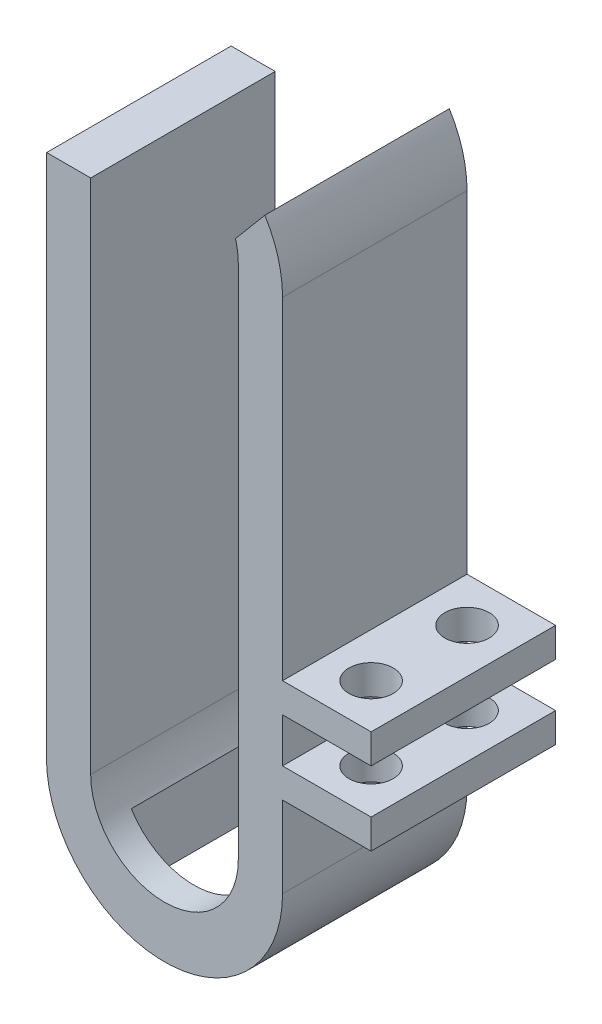
ISO-10303-21;
HEADER;
FILE_DESCRIPTION(('STEP AP214'),'2;1');
FILE_NAME('part.step','',(''),(''),'','','');
FILE_SCHEMA(('AUTOMOTIVE_DESIGN { 1 0 10303 214 1 1 1 1 }'));
ENDSEC;
DATA;
#1=APPLICATION_CONTEXT('core data for automotive mechanical design processes');
#2=APPLICATION_PROTOCOL_DEFINITION('international standard','automotive_design',2000,#1);
#3=PRODUCT_CONTEXT('',#1,'mechanical');
#4=PRODUCT('Part','Part','',(#3));
#5=PRODUCT_RELATED_PRODUCT_CATEGORY('part','',(#4));
#6=PRODUCT_DEFINITION_FORMATION('','',#4);
#7=PRODUCT_DEFINITION_CONTEXT('part definition',#1,'design');
#8=PRODUCT_DEFINITION('design','',#6,#7);
#9=PRODUCT_DEFINITION_SHAPE('','',#8);
#10=(LENGTH_UNIT() NAMED_UNIT(*) SI_UNIT(.MILLI.,.METRE.));
#11=(NAMED_UNIT(*) PLANE_ANGLE_UNIT() SI_UNIT($,.RADIAN.));
#12=(NAMED_UNIT(*) SI_UNIT($,.STERADIAN.) SOLID_ANGLE_UNIT());
#13=UNCERTAINTY_MEASURE_WITH_UNIT(LENGTH_MEASURE(1.E-05),#10,'distance_accuracy_value','');
#14=(GEOMETRIC_REPRESENTATION_CONTEXT(3) GLOBAL_UNCERTAINTY_ASSIGNED_CONTEXT((#13)) GLOBAL_UNIT_ASSIGNED_CONTEXT((#10,
#11,#12)) REPRESENTATION_CONTEXT('',''));
#15=CARTESIAN_POINT('',(0.,0.,0.));
#16=DIRECTION('',(0.,0.,1.));
#17=DIRECTION('',(1.,0.,0.));
#18=AXIS2_PLACEMENT_3D('',#15,#16,#17);
#19=CARTESIAN_POINT('',(7.99999999999995,0.,12.5));
#20=DIRECTION('',(1.,0.,0.));
#21=DIRECTION('',(0.,1.,0.));
#22=AXIS2_PLACEMENT_3D('',#19,#20,#21);
#23=PLANE('',#22);
#24=DIRECTION('',(0.,-1.,0.));
#25=VECTOR('',#24,1.);
#26=CARTESIAN_POINT('',(7.99999999999995,0.,0.));
#27=LINE('',#26,#25);
#28=CARTESIAN_POINT('',(7.99999999999994,-7.5,0.));
#29=VERTEX_POINT('',#28);
#30=CARTESIAN_POINT('',(7.99999999999995,-10.5,0.));
#31=VERTEX_POINT('',#30);
#32=EDGE_CURVE('E278',#29,#31,#27,.T.);
#33=ORIENTED_EDGE('',*,*,#32,.F.);
#34=DIRECTION('',(0.,0.,-1.));
#35=VECTOR('',#34,1.);
#36=CARTESIAN_POINT('',(7.99999999999995,-7.5,12.5));
#37=LINE('',#36,#35);
#38=CARTESIAN_POINT('',(7.99999999999995,-7.5,12.5));
#39=VERTEX_POINT('',#38);
#40=EDGE_CURVE('E347',#39,#29,#37,.T.);
#41=ORIENTED_EDGE('',*,*,#40,.F.);
#42=DIRECTION('',(0.,-1.,0.));
#43=VECTOR('',#42,1.);
#44=CARTESIAN_POINT('',(7.99999999999995,0.,12.5));
#45=LINE('',#44,#43);
#46=CARTESIAN_POINT('',(7.99999999999995,-10.5,12.5));
#47=VERTEX_POINT('',#46);
#48=EDGE_CURVE('E308',#39,#47,#45,.T.);
#49=ORIENTED_EDGE('',*,*,#48,.T.);
#50=DIRECTION('',(0.,0.,1.));
#51=VECTOR('',#50,1.);
#52=CARTESIAN_POINT('',(7.99999999999995,-10.5,12.5));
#53=LINE('',#52,#51);
#54=EDGE_CURVE('E320',#31,#47,#53,.T.);
#55=ORIENTED_EDGE('',*,*,#54,.F.);
#56=EDGE_LOOP('',(#33,#41,#49,#55));
#57=FACE_BOUND('',#56,.T.);
#58=ADVANCED_FACE('F37',(#57),#23,.T.);
#59=CARTESIAN_POINT('',(7.99999999999995,17.,12.5));
#60=VERTEX_POINT('',#59);
#61=CARTESIAN_POINT('',(7.99999999999995,-5.5,12.5));
#62=VERTEX_POINT('',#61);
#63=EDGE_CURVE('E305',#60,#62,#45,.T.);
#64=ORIENTED_EDGE('',*,*,#63,.T.);
#65=DIRECTION('',(0.,0.,1.));
#66=VECTOR('',#65,1.);
#67=CARTESIAN_POINT('',(7.99999999999995,-5.5,12.5));
#68=LINE('',#67,#66);
#69=CARTESIAN_POINT('',(7.99999999999995,-5.5,0.));
#70=VERTEX_POINT('',#69);
#71=EDGE_CURVE('E344',#70,#62,#68,.T.);
#72=ORIENTED_EDGE('',*,*,#71,.F.);
#73=CARTESIAN_POINT('',(7.99999999999995,17.,0.));
#74=VERTEX_POINT('',#73);
#75=EDGE_CURVE('E275',#74,#70,#27,.T.);
#76=ORIENTED_EDGE('',*,*,#75,.F.);
#77=DIRECTION('',(0.,0.,-1.));
#78=VECTOR('',#77,1.);
#79=CARTESIAN_POINT('',(7.99999999999995,17.,12.5));
#80=LINE('',#79,#78);
#81=EDGE_CURVE('E194',#60,#74,#80,.T.);
#82=ORIENTED_EDGE('',*,*,#81,.F.);
#83=EDGE_LOOP('',(#64,#72,#76,#82));
#84=FACE_BOUND('',#83,.T.);
#85=ADVANCED_FACE('F401',(#84),#23,.T.);
#86=CARTESIAN_POINT('',(7.99999999999994,-12.5,0.));
#87=VERTEX_POINT('',#86);
#88=CARTESIAN_POINT('',(7.99999999999994,-18.,0.));
#89=VERTEX_POINT('',#88);
#90=EDGE_CURVE('E279',#87,#89,#27,.T.);
#91=ORIENTED_EDGE('',*,*,#90,.F.);
#92=DIRECTION('',(0.,0.,-1.));
#93=VECTOR('',#92,1.);
#94=CARTESIAN_POINT('',(7.99999999999995,-12.5,12.5));
#95=LINE('',#94,#93);
#96=CARTESIAN_POINT('',(7.99999999999995,-12.5,12.5));
#97=VERTEX_POINT('',#96);
#98=EDGE_CURVE('E324',#97,#87,#95,.T.);
#99=ORIENTED_EDGE('',*,*,#98,.F.);
#100=CARTESIAN_POINT('',(7.99999999999994,-18.,12.5));
#101=VERTEX_POINT('',#100);
#102=EDGE_CURVE('E249',#97,#101,#45,.T.);
#103=ORIENTED_EDGE('',*,*,#102,.T.);
#104=DIRECTION('',(0.,0.,-1.));
#105=VECTOR('',#104,1.);
#106=CARTESIAN_POINT('',(7.99999999999994,-18.,12.5));
#107=LINE('',#106,#105);
#108=EDGE_CURVE('E242',#101,#89,#107,.T.);
#109=ORIENTED_EDGE('',*,*,#108,.T.);
#110=EDGE_LOOP('',(#91,#99,#103,#109));
#111=FACE_BOUND('',#110,.T.);
#112=ADVANCED_FACE('F39',(#111),#23,.T.);
#113=CARTESIAN_POINT('',(0.,17.,12.5));
#114=DIRECTION('',(0.,0.,-1.));
#115=DIRECTION('',(-1.,0.,0.));
#116=AXIS2_PLACEMENT_3D('',#113,#114,#115);
#117=CYLINDRICAL_SURFACE('',#116,7.99999999999998);
#118=CARTESIAN_POINT('',(0.,17.,0.));
#119=DIRECTION('',(0.,0.,1.));
#120=DIRECTION('',(1.,0.,0.));
#121=AXIS2_PLACEMENT_3D('',#118,#119,#120);
#122=CIRCLE('',#121,7.99999999999998);
#123=CARTESIAN_POINT('',(6.80020674968517,21.2139278780653,0.));
#124=VERTEX_POINT('',#123);
#125=EDGE_CURVE('E272',#74,#124,#122,.T.);
#126=ORIENTED_EDGE('',*,*,#125,.T.);
#127=DIRECTION('',(0.,0.,-1.));
#128=VECTOR('',#127,1.);
#129=CARTESIAN_POINT('',(6.80020674968517,21.2139278780653,12.5));
#130=LINE('',#129,#128);
#131=CARTESIAN_POINT('',(6.80020674968517,21.2139278780653,12.5));
#132=VERTEX_POINT('',#131);
#133=EDGE_CURVE('E222',#132,#124,#130,.T.);
#134=ORIENTED_EDGE('',*,*,#133,.F.);
#135=CARTESIAN_POINT('',(0.,17.,12.5));
#136=DIRECTION('',(0.,0.,1.));
#137=DIRECTION('',(1.,0.,0.));
#138=AXIS2_PLACEMENT_3D('',#135,#136,#137);
#139=CIRCLE('',#138,7.99999999999998);
#140=EDGE_CURVE('E303',#60,#132,#139,.T.);
#141=ORIENTED_EDGE('',*,*,#140,.F.);
#142=ORIENTED_EDGE('',*,*,#81,.T.);
#143=EDGE_LOOP('',(#126,#134,#141,#142));
#144=FACE_BOUND('',#143,.T.);
#145=ADVANCED_FACE('F409',(#144),#117,.T.);
#146=CARTESIAN_POINT('',(-6.45529519331706,5.4166358158528,12.5));
#147=DIRECTION('',(-0.766044443118979,0.642787609686539,0.));
#148=DIRECTION('',(-0.642787609686539,-0.766044443118979,0.));
#149=AXIS2_PLACEMENT_3D('',#146,#147,#148);
#150=PLANE('',#149);
#151=DIRECTION('',(0.642787609686539,0.766044443118979,0.));
#152=VECTOR('',#151,1.);
#153=CARTESIAN_POINT('',(-6.45529519331706,5.4166358158528,0.));
#154=LINE('',#153,#152);
#155=CARTESIAN_POINT('',(4.81488589525654,18.8479146173477,0.));
#156=VERTEX_POINT('',#155);
#157=EDGE_CURVE('E269',#156,#124,#154,.T.);
#158=ORIENTED_EDGE('',*,*,#157,.F.);
#159=DIRECTION('',(0.,0.,-1.));
#160=VECTOR('',#159,1.);
#161=CARTESIAN_POINT('',(4.81488589525654,18.8479146173477,12.5));
#162=LINE('',#161,#160);
#163=CARTESIAN_POINT('',(4.81488589525654,18.8479146173477,12.5));
#164=VERTEX_POINT('',#163);
#165=EDGE_CURVE('E224',#164,#156,#162,.T.);
#166=ORIENTED_EDGE('',*,*,#165,.F.);
#167=DIRECTION('',(0.642787609686539,0.766044443118979,0.));
#168=VECTOR('',#167,1.);
#169=CARTESIAN_POINT('',(-6.45529519331706,5.4166358158528,12.5));
#170=LINE('',#169,#168);
#171=EDGE_CURVE('E300',#164,#132,#170,.T.);
#172=ORIENTED_EDGE('',*,*,#171,.T.);
#173=ORIENTED_EDGE('',*,*,#133,.T.);
#174=EDGE_LOOP('',(#158,#166,#172,#173));
#175=FACE_BOUND('',#174,.T.);
#176=ADVANCED_FACE('F414',(#175),#150,.T.);
#177=CARTESIAN_POINT('',(0.,17.5,12.5));
#178=DIRECTION('',(0.,0.,-1.));
#179=DIRECTION('',(-1.,0.,0.));
#180=AXIS2_PLACEMENT_3D('',#177,#178,#179);
#181=CYLINDRICAL_SURFACE('',#180,5.00000000000001);
#182=CARTESIAN_POINT('',(0.,17.5,0.));
#183=DIRECTION('',(0.,0.,1.));
#184=DIRECTION('',(1.,0.,0.));
#185=AXIS2_PLACEMENT_3D('',#182,#183,#184);
#186=CIRCLE('',#185,5.00000000000001);
#187=CARTESIAN_POINT('',(5.00000000000001,17.5,0.));
#188=VERTEX_POINT('',#187);
#189=EDGE_CURVE('E266',#188,#156,#186,.T.);
#190=ORIENTED_EDGE('',*,*,#189,.F.);
#191=DIRECTION('',(0.,0.,-1.));
#192=VECTOR('',#191,1.);
#193=CARTESIAN_POINT('',(5.00000000000001,17.5,12.5));
#194=LINE('',#193,#192);
#195=CARTESIAN_POINT('',(5.00000000000001,17.5,12.5));
#196=VERTEX_POINT('',#195);
#197=EDGE_CURVE('E226',#196,#188,#194,.T.);
#198=ORIENTED_EDGE('',*,*,#197,.F.);
#199=CARTESIAN_POINT('',(0.,17.5,12.5));
#200=DIRECTION('',(0.,0.,1.));
#201=DIRECTION('',(1.,0.,0.));
#202=AXIS2_PLACEMENT_3D('',#199,#200,#201);
#203=CIRCLE('',#202,5.00000000000001);
#204=EDGE_CURVE('E297',#196,#164,#203,.T.);
#205=ORIENTED_EDGE('',*,*,#204,.T.);
#206=ORIENTED_EDGE('',*,*,#165,.T.);
#207=EDGE_LOOP('',(#190,#198,#205,#206));
#208=FACE_BOUND('',#207,.T.);
#209=ADVANCED_FACE('F467',(#208),#181,.F.);
#210=CARTESIAN_POINT('',(5.00000000000001,0.,12.5));
#211=DIRECTION('',(1.,0.,0.));
#212=DIRECTION('',(0.,0.,-1.));
#213=AXIS2_PLACEMENT_3D('',#210,#211,#212);
#214=PLANE('',#213);
#215=DIRECTION('',(0.,-1.,0.));
#216=VECTOR('',#215,1.);
#217=CARTESIAN_POINT('',(5.00000000000001,0.,0.));
#218=LINE('',#217,#216);
#219=CARTESIAN_POINT('',(5.00000000000001,-17.5,0.));
#220=VERTEX_POINT('',#219);
#221=EDGE_CURVE('E263',#188,#220,#218,.T.);
#222=ORIENTED_EDGE('',*,*,#221,.T.);
#223=DIRECTION('',(0.,0.,-1.));
#224=VECTOR('',#223,1.);
#225=CARTESIAN_POINT('',(5.00000000000001,-17.5,12.5));
#226=LINE('',#225,#224);
#227=CARTESIAN_POINT('',(5.00000000000001,-17.5,12.5));
#228=VERTEX_POINT('',#227);
#229=EDGE_CURVE('E228',#228,#220,#226,.T.);
#230=ORIENTED_EDGE('',*,*,#229,.F.);
#231=DIRECTION('',(0.,-1.,0.));
#232=VECTOR('',#231,1.);
#233=CARTESIAN_POINT('',(5.00000000000001,0.,12.5));
#234=LINE('',#233,#232);
#235=EDGE_CURVE('E295',#196,#228,#234,.T.);
#236=ORIENTED_EDGE('',*,*,#235,.F.);
#237=ORIENTED_EDGE('',*,*,#197,.T.);
#238=EDGE_LOOP('',(#222,#230,#236,#237));
#239=FACE_BOUND('',#238,.T.);
#240=ADVANCED_FACE('F464',(#239),#214,.F.);
#241=CARTESIAN_POINT('',(0.,-17.5,12.5));
#242=DIRECTION('',(0.,0.,-1.));
#243=DIRECTION('',(-1.,0.,0.));
#244=AXIS2_PLACEMENT_3D('',#241,#242,#243);
#245=CYLINDRICAL_SURFACE('',#244,5.00000000000001);
#246=DIRECTION('',(0.,0.,-1.));
#247=VECTOR('',#246,1.);
#248=CARTESIAN_POINT('',(-4.25,-20.1339134382132,12.5));
#249=LINE('',#248,#247);
#250=CARTESIAN_POINT('',(-4.25,-20.1339134382132,2.));
#251=VERTEX_POINT('',#250);
#252=CARTESIAN_POINT('',(-4.25,-20.1339134382132,10.5));
#253=VERTEX_POINT('',#252);
#254=EDGE_CURVE('E201',#251,#253,#249,.F.);
#255=ORIENTED_EDGE('',*,*,#254,.F.);
#256=CARTESIAN_POINT('',(0.,-17.5,2.));
#257=DIRECTION('',(0.,0.,-1.));
#258=DIRECTION('',(-1.,0.,0.));
#259=AXIS2_PLACEMENT_3D('',#256,#257,#258);
#260=CIRCLE('',#259,5.00000000000001);
#261=CARTESIAN_POINT('',(4.25,-20.1339134382132,2.));
#262=VERTEX_POINT('',#261);
#263=EDGE_CURVE('E373',#262,#251,#260,.T.);
#264=ORIENTED_EDGE('',*,*,#263,.F.);
#265=DIRECTION('',(0.,0.,-1.));
#266=VECTOR('',#265,1.);
#267=CARTESIAN_POINT('',(4.25,-20.1339134382132,12.5));
#268=LINE('',#267,#266);
#269=CARTESIAN_POINT('',(4.25,-20.1339134382132,10.5));
#270=VERTEX_POINT('',#269);
#271=EDGE_CURVE('E375',#270,#262,#268,.T.);
#272=ORIENTED_EDGE('',*,*,#271,.F.);
#273=CARTESIAN_POINT('',(0.,-17.5,10.5));
#274=DIRECTION('',(0.,0.,1.));
#275=DIRECTION('',(1.,0.,0.));
#276=AXIS2_PLACEMENT_3D('',#273,#274,#275);
#277=CIRCLE('',#276,5.00000000000001);
#278=EDGE_CURVE('E377',#253,#270,#277,.T.);
#279=ORIENTED_EDGE('',*,*,#278,.F.);
#280=EDGE_LOOP('',(#255,#264,#272,#279));
#281=FACE_BOUND('',#280,.T.);
#282=CARTESIAN_POINT('',(0.,-17.5,0.));
#283=DIRECTION('',(0.,0.,1.));
#284=DIRECTION('',(1.,0.,0.));
#285=AXIS2_PLACEMENT_3D('',#282,#283,#284);
#286=CIRCLE('',#285,5.00000000000001);
#287=CARTESIAN_POINT('',(-5.,-17.5,0.));
#288=VERTEX_POINT('',#287);
#289=EDGE_CURVE('E260',#288,#220,#286,.T.);
#290=ORIENTED_EDGE('',*,*,#289,.F.);
#291=DIRECTION('',(0.,0.,-1.));
#292=VECTOR('',#291,1.);
#293=CARTESIAN_POINT('',(-5.,-17.5,12.5));
#294=LINE('',#293,#292);
#295=CARTESIAN_POINT('',(-5.,-17.5,12.5));
#296=VERTEX_POINT('',#295);
#297=EDGE_CURVE('E230',#296,#288,#294,.T.);
#298=ORIENTED_EDGE('',*,*,#297,.F.);
#299=CARTESIAN_POINT('',(0.,-17.5,12.5));
#300=DIRECTION('',(0.,0.,1.));
#301=DIRECTION('',(1.,0.,0.));
#302=AXIS2_PLACEMENT_3D('',#299,#300,#301);
#303=CIRCLE('',#302,5.00000000000001);
#304=EDGE_CURVE('E292',#296,#228,#303,.T.);
#305=ORIENTED_EDGE('',*,*,#304,.T.);
#306=ORIENTED_EDGE('',*,*,#229,.T.);
#307=EDGE_LOOP('',(#290,#298,#305,#306));
#308=FACE_BOUND('',#307,.T.);
#309=ADVANCED_FACE('F385',(#281,#308),#245,.F.);
#310=CARTESIAN_POINT('',(-5.,0.,12.5));
#311=DIRECTION('',(1.,0.,0.));
#312=DIRECTION('',(0.,1.,0.));
#313=AXIS2_PLACEMENT_3D('',#310,#311,#312);
#314=PLANE('',#313);
#315=DIRECTION('',(0.,-1.,0.));
#316=VECTOR('',#315,1.);
#317=CARTESIAN_POINT('',(-5.,0.,0.));
#318=LINE('',#317,#316);
#319=CARTESIAN_POINT('',(-5.,17.5,0.));
#320=VERTEX_POINT('',#319);
#321=EDGE_CURVE('E257',#320,#288,#318,.T.);
#322=ORIENTED_EDGE('',*,*,#321,.F.);
#323=DIRECTION('',(0.,0.,-1.));
#324=VECTOR('',#323,1.);
#325=CARTESIAN_POINT('',(-5.,17.5,12.5));
#326=LINE('',#325,#324);
#327=CARTESIAN_POINT('',(-5.,17.5,12.5));
#328=VERTEX_POINT('',#327);
#329=EDGE_CURVE('E232',#328,#320,#326,.T.);
#330=ORIENTED_EDGE('',*,*,#329,.F.);
#331=DIRECTION('',(0.,-1.,0.));
#332=VECTOR('',#331,1.);
#333=CARTESIAN_POINT('',(-5.,0.,12.5));
#334=LINE('',#333,#332);
#335=EDGE_CURVE('E289',#328,#296,#334,.T.);
#336=ORIENTED_EDGE('',*,*,#335,.T.);
#337=ORIENTED_EDGE('',*,*,#297,.T.);
#338=EDGE_LOOP('',(#322,#330,#336,#337));
#339=FACE_BOUND('',#338,.T.);
#340=ADVANCED_FACE('F458',(#339),#314,.T.);
#341=CARTESIAN_POINT('',(0.,17.5,12.5));
#342=DIRECTION('',(0.,1.,0.));
#343=DIRECTION('',(0.,0.,1.));
#344=AXIS2_PLACEMENT_3D('',#341,#342,#343);
#345=PLANE('',#344);
#346=DIRECTION('',(1.,0.,0.));
#347=VECTOR('',#346,1.);
#348=CARTESIAN_POINT('',(0.,17.5,0.));
#349=LINE('',#348,#347);
#350=CARTESIAN_POINT('',(-7.98435971133566,17.5,0.));
#351=VERTEX_POINT('',#350);
#352=EDGE_CURVE('E254',#351,#320,#349,.T.);
#353=ORIENTED_EDGE('',*,*,#352,.F.);
#354=DIRECTION('',(0.,0.,-1.));
#355=VECTOR('',#354,1.);
#356=CARTESIAN_POINT('',(-7.98435971133566,17.5,12.5));
#357=LINE('',#356,#355);
#358=CARTESIAN_POINT('',(-7.98435971133566,17.5,12.5));
#359=VERTEX_POINT('',#358);
#360=EDGE_CURVE('E234',#359,#351,#357,.T.);
#361=ORIENTED_EDGE('',*,*,#360,.F.);
#362=DIRECTION('',(1.,0.,0.));
#363=VECTOR('',#362,1.);
#364=CARTESIAN_POINT('',(0.,17.5,12.5));
#365=LINE('',#364,#363);
#366=EDGE_CURVE('E286',#359,#328,#365,.T.);
#367=ORIENTED_EDGE('',*,*,#366,.T.);
#368=ORIENTED_EDGE('',*,*,#329,.T.);
#369=EDGE_LOOP('',(#353,#361,#367,#368));
#370=FACE_BOUND('',#369,.T.);
#371=ADVANCED_FACE('F453',(#370),#345,.T.);
#372=CARTESIAN_POINT('',(0.,17.,12.5));
#373=DIRECTION('',(0.,0.,-1.));
#374=DIRECTION('',(-1.,0.,0.));
#375=AXIS2_PLACEMENT_3D('',#372,#373,#374);
#376=CYLINDRICAL_SURFACE('',#375,7.99999999999998);
#377=CARTESIAN_POINT('',(0.,17.,0.));
#378=DIRECTION('',(0.,0.,1.));
#379=DIRECTION('',(1.,0.,0.));
#380=AXIS2_PLACEMENT_3D('',#377,#378,#379);
#381=CIRCLE('',#380,7.99999999999998);
#382=CARTESIAN_POINT('',(-8.,17.,0.));
#383=VERTEX_POINT('',#382);
#384=EDGE_CURVE('E252',#351,#383,#381,.T.);
#385=ORIENTED_EDGE('',*,*,#384,.T.);
#386=DIRECTION('',(0.,0.,-1.));
#387=VECTOR('',#386,1.);
#388=CARTESIAN_POINT('',(-8.,17.,12.5));
#389=LINE('',#388,#387);
#390=CARTESIAN_POINT('',(-8.,17.,12.5));
#391=VERTEX_POINT('',#390);
#392=EDGE_CURVE('E236',#391,#383,#389,.T.);
#393=ORIENTED_EDGE('',*,*,#392,.F.);
#394=CARTESIAN_POINT('',(0.,17.,12.5));
#395=DIRECTION('',(0.,0.,1.));
#396=DIRECTION('',(1.,0.,0.));
#397=AXIS2_PLACEMENT_3D('',#394,#395,#396);
#398=CIRCLE('',#397,7.99999999999998);
#399=EDGE_CURVE('E284',#359,#391,#398,.T.);
#400=ORIENTED_EDGE('',*,*,#399,.F.);
#401=ORIENTED_EDGE('',*,*,#360,.T.);
#402=EDGE_LOOP('',(#385,#393,#400,#401));
#403=FACE_BOUND('',#402,.T.);
#404=ADVANCED_FACE('F450',(#403),#376,.T.);
#405=CARTESIAN_POINT('',(-8.,0.,12.5));
#406=DIRECTION('',(1.,0.,0.));
#407=DIRECTION('',(0.,1.,0.));
#408=AXIS2_PLACEMENT_3D('',#405,#406,#407);
#409=PLANE('',#408);
#410=DIRECTION('',(0.,-1.,0.));
#411=VECTOR('',#410,1.);
#412=CARTESIAN_POINT('',(-8.,0.,0.));
#413=LINE('',#412,#411);
#414=CARTESIAN_POINT('',(-8.00000000000001,-17.9999996623705,0.));
#415=VERTEX_POINT('',#414);
#416=EDGE_CURVE('E250',#383,#415,#413,.T.);
#417=ORIENTED_EDGE('',*,*,#416,.T.);
#418=DIRECTION('',(0.,0.,-1.));
#419=VECTOR('',#418,1.);
#420=CARTESIAN_POINT('',(-8.00000000000001,-17.9999996623705,12.5));
#421=LINE('',#420,#419);
#422=CARTESIAN_POINT('',(-8.00000000000001,-17.9999996623705,12.5));
#423=VERTEX_POINT('',#422);
#424=EDGE_CURVE('E239',#423,#415,#421,.T.);
#425=ORIENTED_EDGE('',*,*,#424,.F.);
#426=DIRECTION('',(0.,-1.,0.));
#427=VECTOR('',#426,1.);
#428=CARTESIAN_POINT('',(-8.,0.,12.5));
#429=LINE('',#428,#427);
#430=EDGE_CURVE('E282',#391,#423,#429,.T.);
#431=ORIENTED_EDGE('',*,*,#430,.F.);
#432=ORIENTED_EDGE('',*,*,#392,.T.);
#433=EDGE_LOOP('',(#417,#425,#431,#432));
#434=FACE_BOUND('',#433,.T.);
#435=ADVANCED_FACE('F446',(#434),#409,.F.);
#436=CARTESIAN_POINT('',(0.,-17.9999998311853,12.5));
#437=DIRECTION('',(0.,0.,-1.));
#438=DIRECTION('',(-1.,0.,0.));
#439=AXIS2_PLACEMENT_3D('',#436,#437,#438);
#440=CYLINDRICAL_SURFACE('',#439,7.99999999999998);
#441=DIRECTION('',(0.,0.,-1.));
#442=VECTOR('',#441,1.);
#443=CARTESIAN_POINT('',(-4.25,-24.7777206870482,12.5));
#444=LINE('',#443,#442);
#445=CARTESIAN_POINT('',(-4.25,-24.7777206870482,2.));
#446=VERTEX_POINT('',#445);
#447=CARTESIAN_POINT('',(-4.25,-24.7777206870482,10.5));
#448=VERTEX_POINT('',#447);
#449=EDGE_CURVE('E11',#446,#448,#444,.F.);
#450=ORIENTED_EDGE('',*,*,#449,.T.);
#451=CARTESIAN_POINT('',(0.,-17.9999998311853,10.5));
#452=DIRECTION('',(0.,0.,1.));
#453=DIRECTION('',(1.,0.,0.));
#454=AXIS2_PLACEMENT_3D('',#451,#452,#453);
#455=CIRCLE('',#454,7.99999999999998);
#456=CARTESIAN_POINT('',(4.25,-24.7777206870482,10.5));
#457=VERTEX_POINT('',#456);
#458=EDGE_CURVE('E189',#448,#457,#455,.T.);
#459=ORIENTED_EDGE('',*,*,#458,.T.);
#460=DIRECTION('',(0.,0.,-1.));
#461=VECTOR('',#460,1.);
#462=CARTESIAN_POINT('',(4.25,-24.7777206870482,12.5));
#463=LINE('',#462,#461);
#464=CARTESIAN_POINT('',(4.25,-24.7777206870482,2.));
#465=VERTEX_POINT('',#464);
#466=EDGE_CURVE('E193',#457,#465,#463,.T.);
#467=ORIENTED_EDGE('',*,*,#466,.T.);
#468=CARTESIAN_POINT('',(0.,-17.9999998311853,2.));
#469=DIRECTION('',(0.,0.,-1.));
#470=DIRECTION('',(-1.,0.,0.));
#471=AXIS2_PLACEMENT_3D('',#468,#469,#470);
#472=CIRCLE('',#471,7.99999999999998);
#473=EDGE_CURVE('E45',#465,#446,#472,.T.);
#474=ORIENTED_EDGE('',*,*,#473,.T.);
#475=EDGE_LOOP('',(#450,#459,#467,#474));
#476=FACE_BOUND('',#475,.T.);
#477=CARTESIAN_POINT('',(0.,-17.9999998311853,0.));
#478=DIRECTION('',(0.,0.,1.));
#479=DIRECTION('',(1.,0.,0.));
#480=AXIS2_PLACEMENT_3D('',#477,#478,#479);
#481=CIRCLE('',#480,7.99999999999998);
#482=EDGE_CURVE('E246',#415,#89,#481,.T.);
#483=ORIENTED_EDGE('',*,*,#482,.T.);
#484=ORIENTED_EDGE('',*,*,#108,.F.);
#485=CARTESIAN_POINT('',(0.,-17.9999998311853,12.5));
#486=DIRECTION('',(0.,0.,1.));
#487=DIRECTION('',(1.,0.,0.));
#488=AXIS2_PLACEMENT_3D('',#485,#486,#487);
#489=CIRCLE('',#488,7.99999999999998);
#490=EDGE_CURVE('E245',#423,#101,#489,.T.);
#491=ORIENTED_EDGE('',*,*,#490,.F.);
#492=ORIENTED_EDGE('',*,*,#424,.T.);
#493=EDGE_LOOP('',(#483,#484,#491,#492));
#494=FACE_BOUND('',#493,.T.);
#495=ADVANCED_FACE('F205',(#476,#494),#440,.T.);
#496=CARTESIAN_POINT('',(0.,0.,12.5));
#497=DIRECTION('',(0.,0.,1.));
#498=DIRECTION('',(1.,0.,0.));
#499=AXIS2_PLACEMENT_3D('',#496,#497,#498);
#500=PLANE('',#499);
#501=ORIENTED_EDGE('',*,*,#63,.F.);
#502=ORIENTED_EDGE('',*,*,#140,.T.);
#503=ORIENTED_EDGE('',*,*,#171,.F.);
#504=ORIENTED_EDGE('',*,*,#204,.F.);
#505=ORIENTED_EDGE('',*,*,#235,.T.);
#506=ORIENTED_EDGE('',*,*,#304,.F.);
#507=ORIENTED_EDGE('',*,*,#335,.F.);
#508=ORIENTED_EDGE('',*,*,#366,.F.);
#509=ORIENTED_EDGE('',*,*,#399,.T.);
#510=ORIENTED_EDGE('',*,*,#430,.T.);
#511=ORIENTED_EDGE('',*,*,#490,.T.);
#512=ORIENTED_EDGE('',*,*,#102,.F.);
#513=DIRECTION('',(-1.,0.,0.));
#514=VECTOR('',#513,1.);
#515=CARTESIAN_POINT('',(14.,-12.5,12.5));
#516=LINE('',#515,#514);
#517=CARTESIAN_POINT('',(14.,-12.5,12.5));
#518=VERTEX_POINT('',#517);
#519=EDGE_CURVE('E309',#518,#97,#516,.T.);
#520=ORIENTED_EDGE('',*,*,#519,.F.);
#521=DIRECTION('',(0.,-1.,0.));
#522=VECTOR('',#521,1.);
#523=CARTESIAN_POINT('',(14.,-12.5,12.5));
#524=LINE('',#523,#522);
#525=CARTESIAN_POINT('',(13.9999999999999,-10.5,12.5));
#526=VERTEX_POINT('',#525);
#527=EDGE_CURVE('E323',#526,#518,#524,.T.);
#528=ORIENTED_EDGE('',*,*,#527,.F.);
#529=DIRECTION('',(-1.,0.,0.));
#530=VECTOR('',#529,1.);
#531=CARTESIAN_POINT('',(13.9999999999999,-10.5,12.5));
#532=LINE('',#531,#530);
#533=EDGE_CURVE('E316',#526,#47,#532,.T.);
#534=ORIENTED_EDGE('',*,*,#533,.T.);
#535=ORIENTED_EDGE('',*,*,#48,.F.);
#536=DIRECTION('',(-1.,0.,0.));
#537=VECTOR('',#536,1.);
#538=CARTESIAN_POINT('',(13.9999999999999,-7.5,12.5));
#539=LINE('',#538,#537);
#540=CARTESIAN_POINT('',(13.9999999999999,-7.5,12.5));
#541=VERTEX_POINT('',#540);
#542=EDGE_CURVE('E327',#541,#39,#539,.T.);
#543=ORIENTED_EDGE('',*,*,#542,.F.);
#544=DIRECTION('',(0.,-1.,0.));
#545=VECTOR('',#544,1.);
#546=CARTESIAN_POINT('',(13.9999999999999,-5.5,12.5));
#547=LINE('',#546,#545);
#548=CARTESIAN_POINT('',(13.9999999999999,-5.5,12.5));
#549=VERTEX_POINT('',#548);
#550=EDGE_CURVE('E346',#549,#541,#547,.T.);
#551=ORIENTED_EDGE('',*,*,#550,.F.);
#552=DIRECTION('',(-1.,0.,0.));
#553=VECTOR('',#552,1.);
#554=CARTESIAN_POINT('',(13.9999999999999,-5.5,12.5));
#555=LINE('',#554,#553);
#556=EDGE_CURVE('E340',#549,#62,#555,.T.);
#557=ORIENTED_EDGE('',*,*,#556,.T.);
#558=EDGE_LOOP('',(#501,#502,#503,#504,#505,#506,#507,#508,#509,#510,#511,#512,#520,#528,#534,
#535,#543,#551,#557));
#559=FACE_BOUND('',#558,.T.);
#560=ADVANCED_FACE('F439',(#559),#500,.T.);
#561=CARTESIAN_POINT('',(0.,0.,0.));
#562=DIRECTION('',(0.,0.,1.));
#563=DIRECTION('',(1.,0.,0.));
#564=AXIS2_PLACEMENT_3D('',#561,#562,#563);
#565=PLANE('',#564);
#566=ORIENTED_EDGE('',*,*,#75,.T.);
#567=DIRECTION('',(-1.,0.,0.));
#568=VECTOR('',#567,1.);
#569=CARTESIAN_POINT('',(13.9999999999999,-5.5,0.));
#570=LINE('',#569,#568);
#571=CARTESIAN_POINT('',(13.9999999999999,-5.5,0.));
#572=VERTEX_POINT('',#571);
#573=EDGE_CURVE('E338',#572,#70,#570,.T.);
#574=ORIENTED_EDGE('',*,*,#573,.F.);
#575=DIRECTION('',(0.,1.,0.));
#576=VECTOR('',#575,1.);
#577=CARTESIAN_POINT('',(13.9999999999999,-5.5,0.));
#578=LINE('',#577,#576);
#579=CARTESIAN_POINT('',(13.9999999999999,-7.5,0.));
#580=VERTEX_POINT('',#579);
#581=EDGE_CURVE('E352',#580,#572,#578,.T.);
#582=ORIENTED_EDGE('',*,*,#581,.F.);
#583=DIRECTION('',(-1.,0.,0.));
#584=VECTOR('',#583,1.);
#585=CARTESIAN_POINT('',(13.9999999999999,-7.5,0.));
#586=LINE('',#585,#584);
#587=EDGE_CURVE('E336',#580,#29,#586,.T.);
#588=ORIENTED_EDGE('',*,*,#587,.T.);
#589=ORIENTED_EDGE('',*,*,#32,.T.);
#590=DIRECTION('',(-1.,0.,0.));
#591=VECTOR('',#590,1.);
#592=CARTESIAN_POINT('',(13.9999999999999,-10.5,0.));
#593=LINE('',#592,#591);
#594=CARTESIAN_POINT('',(13.9999999999999,-10.5,0.));
#595=VERTEX_POINT('',#594);
#596=EDGE_CURVE('E313',#595,#31,#593,.T.);
#597=ORIENTED_EDGE('',*,*,#596,.F.);
#598=DIRECTION('',(0.,1.,0.));
#599=VECTOR('',#598,1.);
#600=CARTESIAN_POINT('',(14.,-12.5,0.));
#601=LINE('',#600,#599);
#602=CARTESIAN_POINT('',(14.,-12.5,0.));
#603=VERTEX_POINT('',#602);
#604=EDGE_CURVE('E329',#603,#595,#601,.T.);
#605=ORIENTED_EDGE('',*,*,#604,.F.);
#606=DIRECTION('',(-1.,0.,0.));
#607=VECTOR('',#606,1.);
#608=CARTESIAN_POINT('',(14.,-12.5,0.));
#609=LINE('',#608,#607);
#610=EDGE_CURVE('E311',#603,#87,#609,.T.);
#611=ORIENTED_EDGE('',*,*,#610,.T.);
#612=ORIENTED_EDGE('',*,*,#90,.T.);
#613=ORIENTED_EDGE('',*,*,#482,.F.);
#614=ORIENTED_EDGE('',*,*,#416,.F.);
#615=ORIENTED_EDGE('',*,*,#384,.F.);
#616=ORIENTED_EDGE('',*,*,#352,.T.);
#617=ORIENTED_EDGE('',*,*,#321,.T.);
#618=ORIENTED_EDGE('',*,*,#289,.T.);
#619=ORIENTED_EDGE('',*,*,#221,.F.);
#620=ORIENTED_EDGE('',*,*,#189,.T.);
#621=ORIENTED_EDGE('',*,*,#157,.T.);
#622=ORIENTED_EDGE('',*,*,#125,.F.);
#623=EDGE_LOOP('',(#566,#574,#582,#588,#589,#597,#605,#611,#612,#613,#614,#615,#616,#617,#618,
#619,#620,#621,#622));
#624=FACE_BOUND('',#623,.T.);
#625=ADVANCED_FACE('F423',(#624),#565,.F.);
#626=CARTESIAN_POINT('',(14.,-12.5,12.5));
#627=DIRECTION('',(0.,1.,0.));
#628=DIRECTION('',(-1.,0.,0.));
#629=AXIS2_PLACEMENT_3D('',#626,#627,#628);
#630=PLANE('',#629);
#631=CARTESIAN_POINT('',(10.9999999999999,-12.5,3.));
#632=DIRECTION('',(0.,1.,0.));
#633=DIRECTION('',(-1.,0.,0.));
#634=AXIS2_PLACEMENT_3D('',#631,#632,#633);
#635=CIRCLE('',#634,1.5);
#636=CARTESIAN_POINT('',(9.49999999999994,-12.5,3.));
#637=VERTEX_POINT('',#636);
#638=EDGE_CURVE('E350',#637,#637,#635,.T.);
#639=ORIENTED_EDGE('',*,*,#638,.T.);
#640=EDGE_LOOP('',(#639));
#641=FACE_BOUND('',#640,.T.);
#642=CARTESIAN_POINT('',(10.9999999999999,-12.5,9.5));
#643=DIRECTION('',(0.,1.,0.));
#644=DIRECTION('',(-1.,0.,0.));
#645=AXIS2_PLACEMENT_3D('',#642,#643,#644);
#646=CIRCLE('',#645,1.5);
#647=CARTESIAN_POINT('',(9.49999999999994,-12.5,9.5));
#648=VERTEX_POINT('',#647);
#649=EDGE_CURVE('E216',#648,#648,#646,.T.);
#650=ORIENTED_EDGE('',*,*,#649,.T.);
#651=EDGE_LOOP('',(#650));
#652=FACE_BOUND('',#651,.T.);
#653=ORIENTED_EDGE('',*,*,#98,.T.);
#654=ORIENTED_EDGE('',*,*,#610,.F.);
#655=DIRECTION('',(0.,0.,-1.));
#656=VECTOR('',#655,1.);
#657=CARTESIAN_POINT('',(14.,-12.5,12.5));
#658=LINE('',#657,#656);
#659=EDGE_CURVE('E331',#518,#603,#658,.T.);
#660=ORIENTED_EDGE('',*,*,#659,.F.);
#661=ORIENTED_EDGE('',*,*,#519,.T.);
#662=EDGE_LOOP('',(#653,#654,#660,#661));
#663=FACE_BOUND('',#662,.T.);
#664=ADVANCED_FACE('F504',(#641,#652,#663),#630,.F.);
#665=CARTESIAN_POINT('',(13.9999999999999,-10.5,12.5));
#666=DIRECTION('',(0.,-1.,0.));
#667=DIRECTION('',(1.,0.,0.));
#668=AXIS2_PLACEMENT_3D('',#665,#666,#667);
#669=PLANE('',#668);
#670=CARTESIAN_POINT('',(10.9999999999999,-10.5,3.));
#671=DIRECTION('',(0.,-1.,0.));
#672=DIRECTION('',(1.,0.,0.));
#673=AXIS2_PLACEMENT_3D('',#670,#671,#672);
#674=CIRCLE('',#673,1.5);
#675=CARTESIAN_POINT('',(12.4999999999999,-10.5,3.));
#676=VERTEX_POINT('',#675);
#677=EDGE_CURVE('E360',#676,#676,#674,.T.);
#678=ORIENTED_EDGE('',*,*,#677,.T.);
#679=EDGE_LOOP('',(#678));
#680=FACE_BOUND('',#679,.T.);
#681=CARTESIAN_POINT('',(10.9999999999999,-10.5,9.5));
#682=DIRECTION('',(0.,-1.,0.));
#683=DIRECTION('',(1.,0.,0.));
#684=AXIS2_PLACEMENT_3D('',#681,#682,#683);
#685=CIRCLE('',#684,1.5);
#686=CARTESIAN_POINT('',(12.4999999999999,-10.5,9.5));
#687=VERTEX_POINT('',#686);
#688=EDGE_CURVE('E367',#687,#687,#685,.T.);
#689=ORIENTED_EDGE('',*,*,#688,.T.);
#690=EDGE_LOOP('',(#689));
#691=FACE_BOUND('',#690,.T.);
#692=ORIENTED_EDGE('',*,*,#54,.T.);
#693=ORIENTED_EDGE('',*,*,#533,.F.);
#694=DIRECTION('',(0.,0.,1.));
#695=VECTOR('',#694,1.);
#696=CARTESIAN_POINT('',(13.9999999999999,-10.5,12.5));
#697=LINE('',#696,#695);
#698=EDGE_CURVE('E319',#595,#526,#697,.T.);
#699=ORIENTED_EDGE('',*,*,#698,.F.);
#700=ORIENTED_EDGE('',*,*,#596,.T.);
#701=EDGE_LOOP('',(#692,#693,#699,#700));
#702=FACE_BOUND('',#701,.T.);
#703=ADVANCED_FACE('F431',(#680,#691,#702),#669,.F.);
#704=CARTESIAN_POINT('',(13.9999999999999,0.,0.));
#705=DIRECTION('',(-1.,0.,0.));
#706=DIRECTION('',(0.,-1.,0.));
#707=AXIS2_PLACEMENT_3D('',#704,#705,#706);
#708=PLANE('',#707);
#709=ORIENTED_EDGE('',*,*,#527,.T.);
#710=ORIENTED_EDGE('',*,*,#659,.T.);
#711=ORIENTED_EDGE('',*,*,#604,.T.);
#712=ORIENTED_EDGE('',*,*,#698,.T.);
#713=EDGE_LOOP('',(#709,#710,#711,#712));
#714=FACE_BOUND('',#713,.T.);
#715=ADVANCED_FACE('F488',(#714),#708,.F.);
#716=CARTESIAN_POINT('',(13.9999999999999,-7.5,12.5));
#717=DIRECTION('',(0.,1.,0.));
#718=DIRECTION('',(-1.,0.,0.));
#719=AXIS2_PLACEMENT_3D('',#716,#717,#718);
#720=PLANE('',#719);
#721=CARTESIAN_POINT('',(10.9999999999999,-7.5,3.));
#722=DIRECTION('',(0.,1.,0.));
#723=DIRECTION('',(-1.,0.,0.));
#724=AXIS2_PLACEMENT_3D('',#721,#722,#723);
#725=CIRCLE('',#724,1.5);
#726=CARTESIAN_POINT('',(9.49999999999994,-7.5,3.));
#727=VERTEX_POINT('',#726);
#728=EDGE_CURVE('E215',#727,#727,#725,.T.);
#729=ORIENTED_EDGE('',*,*,#728,.T.);
#730=EDGE_LOOP('',(#729));
#731=FACE_BOUND('',#730,.T.);
#732=CARTESIAN_POINT('',(10.9999999999999,-7.5,9.5));
#733=DIRECTION('',(0.,1.,0.));
#734=DIRECTION('',(-1.,0.,0.));
#735=AXIS2_PLACEMENT_3D('',#732,#733,#734);
#736=CIRCLE('',#735,1.5);
#737=CARTESIAN_POINT('',(9.49999999999994,-7.5,9.5));
#738=VERTEX_POINT('',#737);
#739=EDGE_CURVE('E220',#738,#738,#736,.T.);
#740=ORIENTED_EDGE('',*,*,#739,.T.);
#741=EDGE_LOOP('',(#740));
#742=FACE_BOUND('',#741,.T.);
#743=ORIENTED_EDGE('',*,*,#40,.T.);
#744=ORIENTED_EDGE('',*,*,#587,.F.);
#745=DIRECTION('',(0.,0.,-1.));
#746=VECTOR('',#745,1.);
#747=CARTESIAN_POINT('',(13.9999999999999,-7.5,12.5));
#748=LINE('',#747,#746);
#749=EDGE_CURVE('E354',#541,#580,#748,.T.);
#750=ORIENTED_EDGE('',*,*,#749,.F.);
#751=ORIENTED_EDGE('',*,*,#542,.T.);
#752=EDGE_LOOP('',(#743,#744,#750,#751));
#753=FACE_BOUND('',#752,.T.);
#754=ADVANCED_FACE('F486',(#731,#742,#753),#720,.F.);
#755=CARTESIAN_POINT('',(13.9999999999999,-5.5,12.5));
#756=DIRECTION('',(0.,-1.,0.));
#757=DIRECTION('',(1.,0.,0.));
#758=AXIS2_PLACEMENT_3D('',#755,#756,#757);
#759=PLANE('',#758);
#760=CARTESIAN_POINT('',(10.9999999999999,-5.5,3.));
#761=DIRECTION('',(0.,-1.,0.));
#762=DIRECTION('',(1.,0.,0.));
#763=AXIS2_PLACEMENT_3D('',#760,#761,#762);
#764=CIRCLE('',#763,1.5);
#765=CARTESIAN_POINT('',(12.4999999999999,-5.5,3.));
#766=VERTEX_POINT('',#765);
#767=EDGE_CURVE('E212',#766,#766,#764,.T.);
#768=ORIENTED_EDGE('',*,*,#767,.T.);
#769=EDGE_LOOP('',(#768));
#770=FACE_BOUND('',#769,.T.);
#771=CARTESIAN_POINT('',(10.9999999999999,-5.5,9.5));
#772=DIRECTION('',(0.,-1.,0.));
#773=DIRECTION('',(1.,0.,0.));
#774=AXIS2_PLACEMENT_3D('',#771,#772,#773);
#775=CIRCLE('',#774,1.5);
#776=CARTESIAN_POINT('',(12.4999999999999,-5.5,9.5));
#777=VERTEX_POINT('',#776);
#778=EDGE_CURVE('E217',#777,#777,#775,.T.);
#779=ORIENTED_EDGE('',*,*,#778,.T.);
#780=EDGE_LOOP('',(#779));
#781=FACE_BOUND('',#780,.T.);
#782=ORIENTED_EDGE('',*,*,#71,.T.);
#783=ORIENTED_EDGE('',*,*,#556,.F.);
#784=DIRECTION('',(0.,0.,1.));
#785=VECTOR('',#784,1.);
#786=CARTESIAN_POINT('',(13.9999999999999,-5.5,12.5));
#787=LINE('',#786,#785);
#788=EDGE_CURVE('E343',#572,#549,#787,.T.);
#789=ORIENTED_EDGE('',*,*,#788,.F.);
#790=ORIENTED_EDGE('',*,*,#573,.T.);
#791=EDGE_LOOP('',(#782,#783,#789,#790));
#792=FACE_BOUND('',#791,.T.);
#793=ADVANCED_FACE('F480',(#770,#781,#792),#759,.F.);
#794=CARTESIAN_POINT('',(13.9999999999999,0.,0.));
#795=DIRECTION('',(1.,0.,0.));
#796=DIRECTION('',(0.,0.,-1.));
#797=AXIS2_PLACEMENT_3D('',#794,#795,#796);
#798=PLANE('',#797);
#799=ORIENTED_EDGE('',*,*,#550,.T.);
#800=ORIENTED_EDGE('',*,*,#749,.T.);
#801=ORIENTED_EDGE('',*,*,#581,.T.);
#802=ORIENTED_EDGE('',*,*,#788,.T.);
#803=EDGE_LOOP('',(#799,#800,#801,#802));
#804=FACE_BOUND('',#803,.T.);
#805=ADVANCED_FACE('F484',(#804),#798,.T.);
#806=CARTESIAN_POINT('',(10.9999999999999,-25.9999998311852,9.5));
#807=DIRECTION('',(0.,1.,0.));
#808=DIRECTION('',(-1.,0.,0.));
#809=AXIS2_PLACEMENT_3D('',#806,#807,#808);
#810=CYLINDRICAL_SURFACE('',#809,1.5);
#811=ORIENTED_EDGE('',*,*,#778,.F.);
#812=EDGE_LOOP('',(#811));
#813=FACE_BOUND('',#812,.T.);
#814=ORIENTED_EDGE('',*,*,#739,.F.);
#815=EDGE_LOOP('',(#814));
#816=FACE_BOUND('',#815,.T.);
#817=ADVANCED_FACE('F597',(#813,#816),#810,.F.);
#818=CARTESIAN_POINT('',(10.9999999999999,-25.9999998311852,3.));
#819=DIRECTION('',(0.,1.,0.));
#820=DIRECTION('',(-1.,0.,0.));
#821=AXIS2_PLACEMENT_3D('',#818,#819,#820);
#822=CYLINDRICAL_SURFACE('',#821,1.5);
#823=ORIENTED_EDGE('',*,*,#767,.F.);
#824=EDGE_LOOP('',(#823));
#825=FACE_BOUND('',#824,.T.);
#826=ORIENTED_EDGE('',*,*,#728,.F.);
#827=EDGE_LOOP('',(#826));
#828=FACE_BOUND('',#827,.T.);
#829=ADVANCED_FACE('F609',(#825,#828),#822,.F.);
#830=ORIENTED_EDGE('',*,*,#688,.F.);
#831=EDGE_LOOP('',(#830));
#832=FACE_BOUND('',#831,.T.);
#833=ORIENTED_EDGE('',*,*,#649,.F.);
#834=EDGE_LOOP('',(#833));
#835=FACE_BOUND('',#834,.T.);
#836=ADVANCED_FACE('F612',(#832,#835),#810,.F.);
#837=ORIENTED_EDGE('',*,*,#677,.F.);
#838=EDGE_LOOP('',(#837));
#839=FACE_BOUND('',#838,.T.);
#840=ORIENTED_EDGE('',*,*,#638,.F.);
#841=EDGE_LOOP('',(#840));
#842=FACE_BOUND('',#841,.T.);
#843=ADVANCED_FACE('F398',(#839,#842),#822,.F.);
#844=CARTESIAN_POINT('',(-4.25,-25.9999998311852,2.));
#845=DIRECTION('',(-1.,0.,0.));
#846=DIRECTION('',(0.,0.,1.));
#847=AXIS2_PLACEMENT_3D('',#844,#845,#846);
#848=PLANE('',#847);
#849=ORIENTED_EDGE('',*,*,#254,.T.);
#850=DIRECTION('',(0.,1.,0.));
#851=VECTOR('',#850,1.);
#852=CARTESIAN_POINT('',(-4.25,-25.9999998311852,10.5));
#853=LINE('',#852,#851);
#854=EDGE_CURVE('E52',#448,#253,#853,.T.);
#855=ORIENTED_EDGE('',*,*,#854,.F.);
#856=ORIENTED_EDGE('',*,*,#449,.F.);
#857=DIRECTION('',(0.,1.,0.));
#858=VECTOR('',#857,1.);
#859=CARTESIAN_POINT('',(-4.25,-25.9999998311852,2.));
#860=LINE('',#859,#858);
#861=EDGE_CURVE('E378',#446,#251,#860,.T.);
#862=ORIENTED_EDGE('',*,*,#861,.T.);
#863=EDGE_LOOP('',(#849,#855,#856,#862));
#864=FACE_BOUND('',#863,.T.);
#865=ADVANCED_FACE('F197',(#864),#848,.F.);
#866=CARTESIAN_POINT('',(-4.25,-25.9999998311852,2.));
#867=DIRECTION('',(0.,0.,-1.));
#868=DIRECTION('',(-1.,0.,0.));
#869=AXIS2_PLACEMENT_3D('',#866,#867,#868);
#870=PLANE('',#869);
#871=ORIENTED_EDGE('',*,*,#263,.T.);
#872=ORIENTED_EDGE('',*,*,#861,.F.);
#873=ORIENTED_EDGE('',*,*,#473,.F.);
#874=DIRECTION('',(0.,1.,0.));
#875=VECTOR('',#874,1.);
#876=CARTESIAN_POINT('',(4.25,-25.9999998311852,2.));
#877=LINE('',#876,#875);
#878=EDGE_CURVE('E381',#465,#262,#877,.T.);
#879=ORIENTED_EDGE('',*,*,#878,.T.);
#880=EDGE_LOOP('',(#871,#872,#873,#879));
#881=FACE_BOUND('',#880,.T.);
#882=ADVANCED_FACE('F390',(#881),#870,.F.);
#883=CARTESIAN_POINT('',(4.25,-25.9999998311852,2.));
#884=DIRECTION('',(1.,0.,0.));
#885=DIRECTION('',(0.,0.,-1.));
#886=AXIS2_PLACEMENT_3D('',#883,#884,#885);
#887=PLANE('',#886);
#888=ORIENTED_EDGE('',*,*,#271,.T.);
#889=ORIENTED_EDGE('',*,*,#878,.F.);
#890=ORIENTED_EDGE('',*,*,#466,.F.);
#891=DIRECTION('',(0.,1.,0.));
#892=VECTOR('',#891,1.);
#893=CARTESIAN_POINT('',(4.25,-25.9999998311852,10.5));
#894=LINE('',#893,#892);
#895=EDGE_CURVE('E57',#457,#270,#894,.T.);
#896=ORIENTED_EDGE('',*,*,#895,.T.);
#897=EDGE_LOOP('',(#888,#889,#890,#896));
#898=FACE_BOUND('',#897,.T.);
#899=ADVANCED_FACE('F389',(#898),#887,.F.);
#900=CARTESIAN_POINT('',(-4.25,-25.9999998311852,10.5));
#901=DIRECTION('',(0.,0.,1.));
#902=DIRECTION('',(1.,0.,0.));
#903=AXIS2_PLACEMENT_3D('',#900,#901,#902);
#904=PLANE('',#903);
#905=ORIENTED_EDGE('',*,*,#278,.T.);
#906=ORIENTED_EDGE('',*,*,#895,.F.);
#907=ORIENTED_EDGE('',*,*,#458,.F.);
#908=ORIENTED_EDGE('',*,*,#854,.T.);
#909=EDGE_LOOP('',(#905,#906,#907,#908));
#910=FACE_BOUND('',#909,.T.);
#911=ADVANCED_FACE('F190',(#910),#904,.F.);
#912=CLOSED_SHELL('',(#58,#85,#112,#145,#176,#209,#240,#309,#340,#371,#404,#435,#495,#560,#625,
#664,#703,#715,#754,#793,#805,#817,#829,#836,#843,#865,#882,#899,#911));
#913=MANIFOLD_SOLID_BREP('B2',#912);
#914=ADVANCED_BREP_SHAPE_REPRESENTATION('',(#18,#913),#14);
#915=SHAPE_DEFINITION_REPRESENTATION(#9,#914);
ENDSEC;
END-ISO-10303-21;
